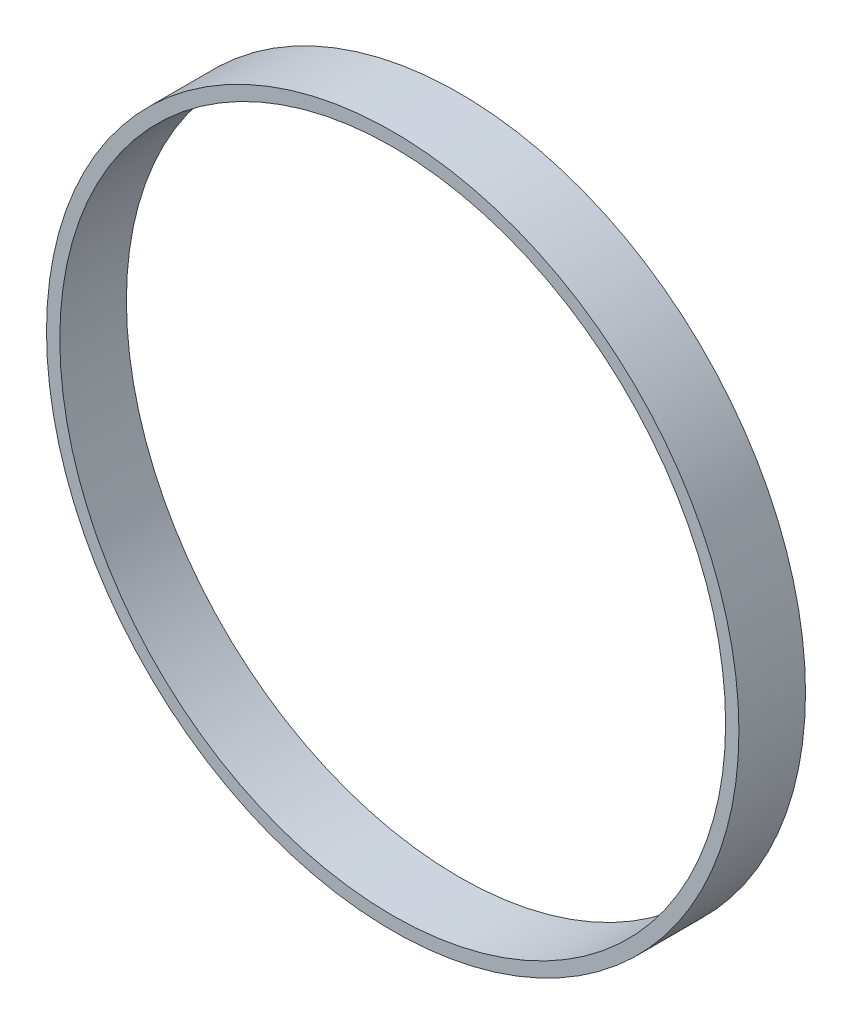
ISO-10303-21;
HEADER;
FILE_DESCRIPTION(('STEP AP214'),'2;1');
FILE_NAME('part.step','',(''),(''),'','','');
FILE_SCHEMA(('AUTOMOTIVE_DESIGN { 1 0 10303 214 1 1 1 1 }'));
ENDSEC;
DATA;
#1=APPLICATION_CONTEXT('core data for automotive mechanical design processes');
#2=APPLICATION_PROTOCOL_DEFINITION('international standard','automotive_design',2000,#1);
#3=PRODUCT_CONTEXT('',#1,'mechanical');
#4=PRODUCT('Part','Part','',(#3));
#5=PRODUCT_RELATED_PRODUCT_CATEGORY('part','',(#4));
#6=PRODUCT_DEFINITION_FORMATION('','',#4);
#7=PRODUCT_DEFINITION_CONTEXT('part definition',#1,'design');
#8=PRODUCT_DEFINITION('design','',#6,#7);
#9=PRODUCT_DEFINITION_SHAPE('','',#8);
#10=(LENGTH_UNIT() NAMED_UNIT(*) SI_UNIT(.MILLI.,.METRE.));
#11=(NAMED_UNIT(*) PLANE_ANGLE_UNIT() SI_UNIT($,.RADIAN.));
#12=(NAMED_UNIT(*) SI_UNIT($,.STERADIAN.) SOLID_ANGLE_UNIT());
#13=UNCERTAINTY_MEASURE_WITH_UNIT(LENGTH_MEASURE(1.E-05),#10,'distance_accuracy_value','');
#14=(GEOMETRIC_REPRESENTATION_CONTEXT(3) GLOBAL_UNCERTAINTY_ASSIGNED_CONTEXT((#13)) GLOBAL_UNIT_ASSIGNED_CONTEXT((#10,
#11,#12)) REPRESENTATION_CONTEXT('',''));
#15=CARTESIAN_POINT('',(0.,0.,0.));
#16=DIRECTION('',(0.,0.,1.));
#17=DIRECTION('',(1.,0.,0.));
#18=AXIS2_PLACEMENT_3D('',#15,#16,#17);
#19=CARTESIAN_POINT('',(0.,0.,20.));
#20=DIRECTION('',(0.,0.,1.));
#21=DIRECTION('',(1.,0.,0.));
#22=AXIS2_PLACEMENT_3D('',#19,#20,#21);
#23=PLANE('',#22);
#24=CARTESIAN_POINT('',(0.,0.,20.));
#25=DIRECTION('',(0.,0.,1.));
#26=DIRECTION('',(1.,0.,0.));
#27=AXIS2_PLACEMENT_3D('',#24,#25,#26);
#28=CIRCLE('',#27,104.);
#29=CARTESIAN_POINT('',(104.,0.,20.));
#30=VERTEX_POINT('',#29);
#31=EDGE_CURVE('E10',#30,#30,#28,.T.);
#32=ORIENTED_EDGE('',*,*,#31,.T.);
#33=EDGE_LOOP('',(#32));
#34=FACE_BOUND('',#33,.T.);
#35=CARTESIAN_POINT('',(0.,0.,20.));
#36=DIRECTION('',(0.,0.,1.));
#37=DIRECTION('',(1.,0.,0.));
#38=AXIS2_PLACEMENT_3D('',#35,#36,#37);
#39=CIRCLE('',#38,100.);
#40=CARTESIAN_POINT('',(100.,0.,20.));
#41=VERTEX_POINT('',#40);
#42=EDGE_CURVE('E42',#41,#41,#39,.T.);
#43=ORIENTED_EDGE('',*,*,#42,.F.);
#44=EDGE_LOOP('',(#43));
#45=FACE_BOUND('',#44,.T.);
#46=ADVANCED_FACE('F31',(#34,#45),#23,.T.);
#47=CARTESIAN_POINT('',(0.,0.,0.));
#48=DIRECTION('',(0.,0.,1.));
#49=DIRECTION('',(1.,0.,0.));
#50=AXIS2_PLACEMENT_3D('',#47,#48,#49);
#51=PLANE('',#50);
#52=CARTESIAN_POINT('',(0.,0.,0.));
#53=DIRECTION('',(0.,0.,1.));
#54=DIRECTION('',(1.,0.,0.));
#55=AXIS2_PLACEMENT_3D('',#52,#53,#54);
#56=CIRCLE('',#55,104.);
#57=CARTESIAN_POINT('',(104.,0.,0.));
#58=VERTEX_POINT('',#57);
#59=EDGE_CURVE('E35',#58,#58,#56,.T.);
#60=ORIENTED_EDGE('',*,*,#59,.F.);
#61=EDGE_LOOP('',(#60));
#62=FACE_BOUND('',#61,.T.);
#63=CARTESIAN_POINT('',(0.,0.,0.));
#64=DIRECTION('',(0.,0.,1.));
#65=DIRECTION('',(1.,0.,0.));
#66=AXIS2_PLACEMENT_3D('',#63,#64,#65);
#67=CIRCLE('',#66,100.);
#68=CARTESIAN_POINT('',(100.,0.,0.));
#69=VERTEX_POINT('',#68);
#70=EDGE_CURVE('E44',#69,#69,#67,.T.);
#71=ORIENTED_EDGE('',*,*,#70,.T.);
#72=EDGE_LOOP('',(#71));
#73=FACE_BOUND('',#72,.T.);
#74=ADVANCED_FACE('F54',(#62,#73),#51,.F.);
#75=CARTESIAN_POINT('',(0.,0.,20.));
#76=DIRECTION('',(0.,0.,-1.));
#77=DIRECTION('',(-1.,0.,0.));
#78=AXIS2_PLACEMENT_3D('',#75,#76,#77);
#79=CYLINDRICAL_SURFACE('',#78,104.);
#80=ORIENTED_EDGE('',*,*,#31,.F.);
#81=EDGE_LOOP('',(#80));
#82=FACE_BOUND('',#81,.T.);
#83=ORIENTED_EDGE('',*,*,#59,.T.);
#84=EDGE_LOOP('',(#83));
#85=FACE_BOUND('',#84,.T.);
#86=ADVANCED_FACE('F33',(#82,#85),#79,.T.);
#87=CARTESIAN_POINT('',(0.,0.,20.));
#88=DIRECTION('',(0.,0.,-1.));
#89=DIRECTION('',(-1.,0.,0.));
#90=AXIS2_PLACEMENT_3D('',#87,#88,#89);
#91=CYLINDRICAL_SURFACE('',#90,100.);
#92=ORIENTED_EDGE('',*,*,#42,.T.);
#93=EDGE_LOOP('',(#92));
#94=FACE_BOUND('',#93,.T.);
#95=ORIENTED_EDGE('',*,*,#70,.F.);
#96=EDGE_LOOP('',(#95));
#97=FACE_BOUND('',#96,.T.);
#98=ADVANCED_FACE('F50',(#94,#97),#91,.F.);
#99=CLOSED_SHELL('',(#46,#74,#86,#98));
#100=MANIFOLD_SOLID_BREP('B2',#99);
#101=ADVANCED_BREP_SHAPE_REPRESENTATION('',(#18,#100),#14);
#102=SHAPE_DEFINITION_REPRESENTATION(#9,#101);
ENDSEC;
END-ISO-10303-21;
